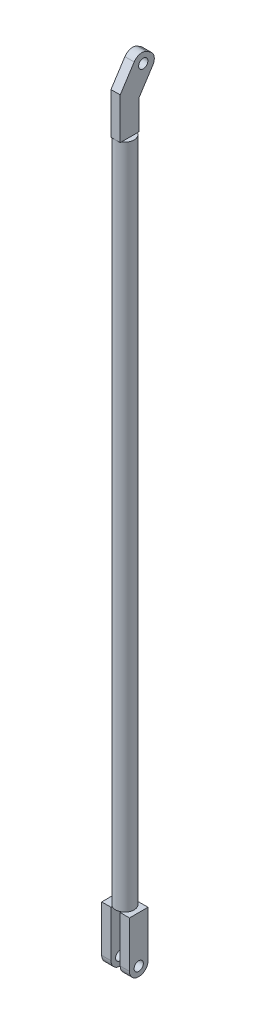
ISO-10303-21;
HEADER;
FILE_DESCRIPTION(('STEP AP214'),'2;1');
FILE_NAME('part.step','',(''),(''),'','','');
FILE_SCHEMA(('AUTOMOTIVE_DESIGN { 1 0 10303 214 1 1 1 1 }'));
ENDSEC;
DATA;
#1=APPLICATION_CONTEXT('core data for automotive mechanical design processes');
#2=APPLICATION_PROTOCOL_DEFINITION('international standard','automotive_design',2000,#1);
#3=PRODUCT_CONTEXT('',#1,'mechanical');
#4=PRODUCT('Part','Part','',(#3));
#5=PRODUCT_RELATED_PRODUCT_CATEGORY('part','',(#4));
#6=PRODUCT_DEFINITION_FORMATION('','',#4);
#7=PRODUCT_DEFINITION_CONTEXT('part definition',#1,'design');
#8=PRODUCT_DEFINITION('design','',#6,#7);
#9=PRODUCT_DEFINITION_SHAPE('','',#8);
#10=(LENGTH_UNIT() NAMED_UNIT(*) SI_UNIT(.MILLI.,.METRE.));
#11=(NAMED_UNIT(*) PLANE_ANGLE_UNIT() SI_UNIT($,.RADIAN.));
#12=(NAMED_UNIT(*) SI_UNIT($,.STERADIAN.) SOLID_ANGLE_UNIT());
#13=UNCERTAINTY_MEASURE_WITH_UNIT(LENGTH_MEASURE(1.E-05),#10,'distance_accuracy_value','');
#14=(GEOMETRIC_REPRESENTATION_CONTEXT(3) GLOBAL_UNCERTAINTY_ASSIGNED_CONTEXT((#13)) GLOBAL_UNIT_ASSIGNED_CONTEXT((#10,
#11,#12)) REPRESENTATION_CONTEXT('',''));
#15=CARTESIAN_POINT('',(0.,0.,0.));
#16=DIRECTION('',(0.,0.,1.));
#17=DIRECTION('',(1.,0.,0.));
#18=AXIS2_PLACEMENT_3D('',#15,#16,#17);
#19=CARTESIAN_POINT('',(0.,457.2,0.));
#20=DIRECTION('',(0.,1.,0.));
#21=DIRECTION('',(0.,0.,1.));
#22=AXIS2_PLACEMENT_3D('',#19,#20,#21);
#23=PLANE('',#22);
#24=CARTESIAN_POINT('',(0.,457.2,0.));
#25=DIRECTION('',(0.,1.,0.));
#26=DIRECTION('',(0.,0.,1.));
#27=AXIS2_PLACEMENT_3D('',#24,#25,#26);
#28=CIRCLE('',#27,12.7);
#29=CARTESIAN_POINT('',(-6.35,457.2,-10.9985226280624));
#30=VERTEX_POINT('',#29);
#31=CARTESIAN_POINT('',(-6.35,457.2,10.9985226280624));
#32=VERTEX_POINT('',#31);
#33=EDGE_CURVE('E390',#30,#32,#28,.T.);
#34=ORIENTED_EDGE('',*,*,#33,.T.);
#35=DIRECTION('',(0.,0.,-1.));
#36=VECTOR('',#35,1.);
#37=CARTESIAN_POINT('',(-6.35,457.2,12.7));
#38=LINE('',#37,#36);
#39=EDGE_CURVE('E268',#32,#30,#38,.T.);
#40=ORIENTED_EDGE('',*,*,#39,.T.);
#41=EDGE_LOOP('',(#34,#40));
#42=FACE_BOUND('',#41,.T.);
#43=ADVANCED_FACE('F30',(#42),#23,.T.);
#44=CARTESIAN_POINT('',(0.,-457.2,0.));
#45=DIRECTION('',(0.,1.,0.));
#46=DIRECTION('',(0.,0.,1.));
#47=AXIS2_PLACEMENT_3D('',#44,#45,#46);
#48=PLANE('',#47);
#49=DIRECTION('',(0.,0.,1.));
#50=VECTOR('',#49,1.);
#51=CARTESIAN_POINT('',(-6.35,-457.2,-12.7));
#52=LINE('',#51,#50);
#53=CARTESIAN_POINT('',(-6.35,-457.2,-10.9985226280624));
#54=VERTEX_POINT('',#53);
#55=CARTESIAN_POINT('',(-6.35,-457.2,10.9985226280624));
#56=VERTEX_POINT('',#55);
#57=EDGE_CURVE('E225',#54,#56,#52,.T.);
#58=ORIENTED_EDGE('',*,*,#57,.F.);
#59=CARTESIAN_POINT('',(0.,-457.2,0.));
#60=DIRECTION('',(0.,1.,0.));
#61=DIRECTION('',(0.,0.,1.));
#62=AXIS2_PLACEMENT_3D('',#59,#60,#61);
#63=CIRCLE('',#62,12.7);
#64=CARTESIAN_POINT('',(6.35,-457.2,-10.9985226280624));
#65=VERTEX_POINT('',#64);
#66=EDGE_CURVE('E264',#65,#54,#63,.T.);
#67=ORIENTED_EDGE('',*,*,#66,.F.);
#68=DIRECTION('',(0.,0.,-1.));
#69=VECTOR('',#68,1.);
#70=CARTESIAN_POINT('',(6.35,-457.2,-12.7));
#71=LINE('',#70,#69);
#72=CARTESIAN_POINT('',(6.35,-457.2,10.9985226280624));
#73=VERTEX_POINT('',#72);
#74=EDGE_CURVE('E247',#73,#65,#71,.T.);
#75=ORIENTED_EDGE('',*,*,#74,.F.);
#76=EDGE_CURVE('E258',#56,#73,#63,.T.);
#77=ORIENTED_EDGE('',*,*,#76,.F.);
#78=EDGE_LOOP('',(#58,#67,#75,#77));
#79=FACE_BOUND('',#78,.T.);
#80=ADVANCED_FACE('F432',(#79),#48,.F.);
#81=CARTESIAN_POINT('',(0.,457.2,0.));
#82=DIRECTION('',(0.,-1.,0.));
#83=DIRECTION('',(0.,0.,-1.));
#84=AXIS2_PLACEMENT_3D('',#81,#82,#83);
#85=CYLINDRICAL_SURFACE('',#84,12.7);
#86=CARTESIAN_POINT('',(0.,457.2,12.7));
#87=VERTEX_POINT('',#86);
#88=CARTESIAN_POINT('',(6.35,457.2,10.9985226280624));
#89=VERTEX_POINT('',#88);
#90=EDGE_CURVE('E187',#87,#89,#28,.T.);
#91=ORIENTED_EDGE('',*,*,#90,.F.);
#92=EDGE_CURVE('E261',#32,#87,#28,.T.);
#93=ORIENTED_EDGE('',*,*,#92,.F.);
#94=ORIENTED_EDGE('',*,*,#33,.F.);
#95=CARTESIAN_POINT('',(6.35,457.2,-10.9985226280624));
#96=VERTEX_POINT('',#95);
#97=EDGE_CURVE('E391',#96,#30,#28,.T.);
#98=ORIENTED_EDGE('',*,*,#97,.F.);
#99=EDGE_CURVE('E260',#89,#96,#28,.T.);
#100=ORIENTED_EDGE('',*,*,#99,.F.);
#101=EDGE_LOOP('',(#91,#93,#94,#98,#100));
#102=FACE_BOUND('',#101,.T.);
#103=EDGE_CURVE('E262',#73,#65,#63,.T.);
#104=ORIENTED_EDGE('',*,*,#103,.T.);
#105=ORIENTED_EDGE('',*,*,#66,.T.);
#106=EDGE_CURVE('E433',#54,#56,#63,.T.);
#107=ORIENTED_EDGE('',*,*,#106,.T.);
#108=ORIENTED_EDGE('',*,*,#76,.T.);
#109=EDGE_LOOP('',(#104,#105,#107,#108));
#110=FACE_BOUND('',#109,.T.);
#111=ADVANCED_FACE('F398',(#102,#110),#85,.T.);
#112=DIRECTION('',(0.,0.,-1.));
#113=VECTOR('',#112,1.);
#114=CARTESIAN_POINT('',(6.35,457.2,12.7));
#115=LINE('',#114,#113);
#116=EDGE_CURVE('E193',#89,#96,#115,.T.);
#117=ORIENTED_EDGE('',*,*,#116,.F.);
#118=ORIENTED_EDGE('',*,*,#99,.T.);
#119=EDGE_LOOP('',(#117,#118));
#120=FACE_BOUND('',#119,.T.);
#121=ADVANCED_FACE('F397',(#120),#23,.T.);
#122=CARTESIAN_POINT('',(19.05,-457.2,12.7));
#123=DIRECTION('',(0.,1.,0.));
#124=DIRECTION('',(0.,0.,1.));
#125=AXIS2_PLACEMENT_3D('',#122,#123,#124);
#126=PLANE('',#125);
#127=ORIENTED_EDGE('',*,*,#103,.F.);
#128=CARTESIAN_POINT('',(6.35,-457.2,12.7));
#129=VERTEX_POINT('',#128);
#130=EDGE_CURVE('E243',#129,#73,#71,.T.);
#131=ORIENTED_EDGE('',*,*,#130,.F.);
#132=DIRECTION('',(-1.,0.,0.));
#133=VECTOR('',#132,1.);
#134=CARTESIAN_POINT('',(6.35,-457.2,12.7));
#135=LINE('',#134,#133);
#136=CARTESIAN_POINT('',(19.05,-457.2,12.7));
#137=VERTEX_POINT('',#136);
#138=EDGE_CURVE('E239',#137,#129,#135,.T.);
#139=ORIENTED_EDGE('',*,*,#138,.F.);
#140=DIRECTION('',(0.,0.,1.));
#141=VECTOR('',#140,1.);
#142=CARTESIAN_POINT('',(19.05,-457.2,-12.7));
#143=LINE('',#142,#141);
#144=CARTESIAN_POINT('',(19.05,-457.2,-12.7));
#145=VERTEX_POINT('',#144);
#146=EDGE_CURVE('E236',#145,#137,#143,.T.);
#147=ORIENTED_EDGE('',*,*,#146,.F.);
#148=DIRECTION('',(1.,0.,0.));
#149=VECTOR('',#148,1.);
#150=CARTESIAN_POINT('',(6.35,-457.2,-12.7));
#151=LINE('',#150,#149);
#152=CARTESIAN_POINT('',(6.35,-457.2,-12.7));
#153=VERTEX_POINT('',#152);
#154=EDGE_CURVE('E246',#153,#145,#151,.T.);
#155=ORIENTED_EDGE('',*,*,#154,.F.);
#156=EDGE_CURVE('E242',#65,#153,#71,.T.);
#157=ORIENTED_EDGE('',*,*,#156,.F.);
#158=EDGE_LOOP('',(#127,#131,#139,#147,#155,#157));
#159=FACE_BOUND('',#158,.T.);
#160=ADVANCED_FACE('F410',(#159),#126,.T.);
#161=CARTESIAN_POINT('',(19.05,-533.4,-12.7));
#162=DIRECTION('',(-1.,0.,0.));
#163=DIRECTION('',(0.,0.,1.));
#164=AXIS2_PLACEMENT_3D('',#161,#162,#163);
#165=PLANE('',#164);
#166=CARTESIAN_POINT('',(19.05,-520.7,0.));
#167=DIRECTION('',(-1.,0.,0.));
#168=DIRECTION('',(0.,0.,1.));
#169=AXIS2_PLACEMENT_3D('',#166,#167,#168);
#170=CIRCLE('',#169,6.34999999999997);
#171=CARTESIAN_POINT('',(19.05,-520.7,6.34999999999997));
#172=VERTEX_POINT('',#171);
#173=EDGE_CURVE('E320',#172,#172,#170,.T.);
#174=ORIENTED_EDGE('',*,*,#173,.T.);
#175=EDGE_LOOP('',(#174));
#176=FACE_BOUND('',#175,.T.);
#177=CARTESIAN_POINT('',(19.05,-520.7,0.));
#178=DIRECTION('',(-1.,0.,0.));
#179=DIRECTION('',(0.,0.,1.));
#180=AXIS2_PLACEMENT_3D('',#177,#178,#179);
#181=CIRCLE('',#180,12.7);
#182=CARTESIAN_POINT('',(19.05,-520.7,12.7));
#183=VERTEX_POINT('',#182);
#184=CARTESIAN_POINT('',(19.05,-533.4,0.));
#185=VERTEX_POINT('',#184);
#186=EDGE_CURVE('E295',#183,#185,#181,.F.);
#187=ORIENTED_EDGE('',*,*,#186,.T.);
#188=CARTESIAN_POINT('',(19.05,-520.7,0.));
#189=DIRECTION('',(-1.,0.,0.));
#190=DIRECTION('',(0.,0.,1.));
#191=AXIS2_PLACEMENT_3D('',#188,#189,#190);
#192=CIRCLE('',#191,12.7);
#193=CARTESIAN_POINT('',(19.05,-520.7,-12.7));
#194=VERTEX_POINT('',#193);
#195=EDGE_CURVE('E297',#185,#194,#192,.F.);
#196=ORIENTED_EDGE('',*,*,#195,.T.);
#197=DIRECTION('',(0.,1.,0.));
#198=VECTOR('',#197,1.);
#199=CARTESIAN_POINT('',(19.05,-533.4,-12.7));
#200=LINE('',#199,#198);
#201=EDGE_CURVE('E250',#194,#145,#200,.T.);
#202=ORIENTED_EDGE('',*,*,#201,.T.);
#203=ORIENTED_EDGE('',*,*,#146,.T.);
#204=DIRECTION('',(0.,1.,0.));
#205=VECTOR('',#204,1.);
#206=CARTESIAN_POINT('',(19.05,-533.4,12.7));
#207=LINE('',#206,#205);
#208=EDGE_CURVE('E256',#183,#137,#207,.T.);
#209=ORIENTED_EDGE('',*,*,#208,.F.);
#210=EDGE_LOOP('',(#187,#196,#202,#203,#209));
#211=FACE_BOUND('',#210,.T.);
#212=ADVANCED_FACE('F418',(#176,#211),#165,.F.);
#213=CARTESIAN_POINT('',(6.35,-533.4,12.7));
#214=DIRECTION('',(0.,0.,-1.));
#215=DIRECTION('',(-1.,0.,0.));
#216=AXIS2_PLACEMENT_3D('',#213,#214,#215);
#217=PLANE('',#216);
#218=DIRECTION('',(0.,1.,0.));
#219=VECTOR('',#218,1.);
#220=CARTESIAN_POINT('',(6.35,-533.4,12.7));
#221=LINE('',#220,#219);
#222=CARTESIAN_POINT('',(6.35,-520.7,12.7));
#223=VERTEX_POINT('',#222);
#224=EDGE_CURVE('E254',#223,#129,#221,.T.);
#225=ORIENTED_EDGE('',*,*,#224,.F.);
#226=DIRECTION('',(-1.,0.,0.));
#227=VECTOR('',#226,1.);
#228=CARTESIAN_POINT('',(6.35,-520.7,12.7));
#229=LINE('',#228,#227);
#230=EDGE_CURVE('E39',#223,#183,#229,.F.);
#231=ORIENTED_EDGE('',*,*,#230,.T.);
#232=ORIENTED_EDGE('',*,*,#208,.T.);
#233=ORIENTED_EDGE('',*,*,#138,.T.);
#234=EDGE_LOOP('',(#225,#231,#232,#233));
#235=FACE_BOUND('',#234,.T.);
#236=ADVANCED_FACE('F424',(#235),#217,.F.);
#237=CARTESIAN_POINT('',(6.35,-533.4,-12.7));
#238=DIRECTION('',(1.,0.,0.));
#239=DIRECTION('',(0.,0.,-1.));
#240=AXIS2_PLACEMENT_3D('',#237,#238,#239);
#241=PLANE('',#240);
#242=CARTESIAN_POINT('',(6.35,-520.7,0.));
#243=DIRECTION('',(1.,0.,0.));
#244=DIRECTION('',(0.,0.,-1.));
#245=AXIS2_PLACEMENT_3D('',#242,#243,#244);
#246=CIRCLE('',#245,6.34999999999997);
#247=CARTESIAN_POINT('',(6.35,-520.7,-6.34999999999997));
#248=VERTEX_POINT('',#247);
#249=EDGE_CURVE('E736',#248,#248,#246,.T.);
#250=ORIENTED_EDGE('',*,*,#249,.T.);
#251=EDGE_LOOP('',(#250));
#252=FACE_BOUND('',#251,.T.);
#253=DIRECTION('',(0.,1.,0.));
#254=VECTOR('',#253,1.);
#255=CARTESIAN_POINT('',(6.35,-533.4,-12.7));
#256=LINE('',#255,#254);
#257=CARTESIAN_POINT('',(6.35,-520.7,-12.7));
#258=VERTEX_POINT('',#257);
#259=EDGE_CURVE('E252',#258,#153,#256,.T.);
#260=ORIENTED_EDGE('',*,*,#259,.F.);
#261=CARTESIAN_POINT('',(6.35,-520.7,0.));
#262=DIRECTION('',(1.,0.,0.));
#263=DIRECTION('',(0.,0.,-1.));
#264=AXIS2_PLACEMENT_3D('',#261,#262,#263);
#265=CIRCLE('',#264,12.7);
#266=CARTESIAN_POINT('',(6.35,-533.4,0.));
#267=VERTEX_POINT('',#266);
#268=EDGE_CURVE('E52',#258,#267,#265,.F.);
#269=ORIENTED_EDGE('',*,*,#268,.T.);
#270=CARTESIAN_POINT('',(6.35,-520.7,0.));
#271=DIRECTION('',(1.,0.,0.));
#272=DIRECTION('',(0.,0.,-1.));
#273=AXIS2_PLACEMENT_3D('',#270,#271,#272);
#274=CIRCLE('',#273,12.7);
#275=EDGE_CURVE('E47',#267,#223,#274,.F.);
#276=ORIENTED_EDGE('',*,*,#275,.T.);
#277=ORIENTED_EDGE('',*,*,#224,.T.);
#278=ORIENTED_EDGE('',*,*,#130,.T.);
#279=ORIENTED_EDGE('',*,*,#74,.T.);
#280=ORIENTED_EDGE('',*,*,#156,.T.);
#281=EDGE_LOOP('',(#260,#269,#276,#277,#278,#279,#280));
#282=FACE_BOUND('',#281,.T.);
#283=ADVANCED_FACE('F406',(#252,#282),#241,.F.);
#284=CARTESIAN_POINT('',(6.35,-533.4,-12.7));
#285=DIRECTION('',(0.,0.,1.));
#286=DIRECTION('',(1.,0.,0.));
#287=AXIS2_PLACEMENT_3D('',#284,#285,#286);
#288=PLANE('',#287);
#289=ORIENTED_EDGE('',*,*,#201,.F.);
#290=DIRECTION('',(1.,0.,0.));
#291=VECTOR('',#290,1.);
#292=CARTESIAN_POINT('',(6.35,-520.7,-12.7));
#293=LINE('',#292,#291);
#294=EDGE_CURVE('E299',#194,#258,#293,.F.);
#295=ORIENTED_EDGE('',*,*,#294,.T.);
#296=ORIENTED_EDGE('',*,*,#259,.T.);
#297=ORIENTED_EDGE('',*,*,#154,.T.);
#298=EDGE_LOOP('',(#289,#295,#296,#297));
#299=FACE_BOUND('',#298,.T.);
#300=ADVANCED_FACE('F414',(#299),#288,.F.);
#301=CARTESIAN_POINT('',(-19.05,-457.2,12.7));
#302=DIRECTION('',(0.,1.,0.));
#303=DIRECTION('',(0.,0.,1.));
#304=AXIS2_PLACEMENT_3D('',#301,#302,#303);
#305=PLANE('',#304);
#306=ORIENTED_EDGE('',*,*,#106,.F.);
#307=CARTESIAN_POINT('',(-6.35,-457.2,-12.7));
#308=VERTEX_POINT('',#307);
#309=EDGE_CURVE('E221',#308,#54,#52,.T.);
#310=ORIENTED_EDGE('',*,*,#309,.F.);
#311=DIRECTION('',(1.,0.,0.));
#312=VECTOR('',#311,1.);
#313=CARTESIAN_POINT('',(-19.05,-457.2,-12.7));
#314=LINE('',#313,#312);
#315=CARTESIAN_POINT('',(-19.05,-457.2,-12.7));
#316=VERTEX_POINT('',#315);
#317=EDGE_CURVE('E212',#316,#308,#314,.T.);
#318=ORIENTED_EDGE('',*,*,#317,.F.);
#319=DIRECTION('',(0.,0.,-1.));
#320=VECTOR('',#319,1.);
#321=CARTESIAN_POINT('',(-19.05,-457.2,-12.7));
#322=LINE('',#321,#320);
#323=CARTESIAN_POINT('',(-19.05,-457.2,12.7));
#324=VERTEX_POINT('',#323);
#325=EDGE_CURVE('E209',#324,#316,#322,.T.);
#326=ORIENTED_EDGE('',*,*,#325,.F.);
#327=DIRECTION('',(-1.,0.,0.));
#328=VECTOR('',#327,1.);
#329=CARTESIAN_POINT('',(-19.05,-457.2,12.7));
#330=LINE('',#329,#328);
#331=CARTESIAN_POINT('',(-6.35,-457.2,12.7));
#332=VERTEX_POINT('',#331);
#333=EDGE_CURVE('E224',#332,#324,#330,.T.);
#334=ORIENTED_EDGE('',*,*,#333,.F.);
#335=EDGE_CURVE('E220',#56,#332,#52,.T.);
#336=ORIENTED_EDGE('',*,*,#335,.F.);
#337=EDGE_LOOP('',(#306,#310,#318,#326,#334,#336));
#338=FACE_BOUND('',#337,.T.);
#339=ADVANCED_FACE('F437',(#338),#305,.T.);
#340=CARTESIAN_POINT('',(-19.05,-533.4,-12.7));
#341=DIRECTION('',(1.,0.,0.));
#342=DIRECTION('',(0.,0.,-1.));
#343=AXIS2_PLACEMENT_3D('',#340,#341,#342);
#344=PLANE('',#343);
#345=CARTESIAN_POINT('',(-19.05,-520.7,0.));
#346=DIRECTION('',(-1.,0.,0.));
#347=DIRECTION('',(0.,0.,1.));
#348=AXIS2_PLACEMENT_3D('',#345,#346,#347);
#349=CIRCLE('',#348,6.34999999999997);
#350=CARTESIAN_POINT('',(-19.05,-520.7,6.34999999999997));
#351=VERTEX_POINT('',#350);
#352=EDGE_CURVE('E741',#351,#351,#349,.T.);
#353=ORIENTED_EDGE('',*,*,#352,.F.);
#354=EDGE_LOOP('',(#353));
#355=FACE_BOUND('',#354,.T.);
#356=DIRECTION('',(0.,1.,0.));
#357=VECTOR('',#356,1.);
#358=CARTESIAN_POINT('',(-19.05,-533.4,-12.7));
#359=LINE('',#358,#357);
#360=CARTESIAN_POINT('',(-19.05,-520.7,-12.7));
#361=VERTEX_POINT('',#360);
#362=EDGE_CURVE('E234',#361,#316,#359,.T.);
#363=ORIENTED_EDGE('',*,*,#362,.F.);
#364=CARTESIAN_POINT('',(-19.05,-520.7,0.));
#365=DIRECTION('',(1.,0.,0.));
#366=DIRECTION('',(0.,0.,-1.));
#367=AXIS2_PLACEMENT_3D('',#364,#365,#366);
#368=CIRCLE('',#367,12.7);
#369=CARTESIAN_POINT('',(-19.05,-533.4,0.));
#370=VERTEX_POINT('',#369);
#371=EDGE_CURVE('E293',#361,#370,#368,.F.);
#372=ORIENTED_EDGE('',*,*,#371,.T.);
#373=CARTESIAN_POINT('',(-19.05,-520.7,0.));
#374=DIRECTION('',(1.,0.,0.));
#375=DIRECTION('',(0.,0.,-1.));
#376=AXIS2_PLACEMENT_3D('',#373,#374,#375);
#377=CIRCLE('',#376,12.7);
#378=CARTESIAN_POINT('',(-19.05,-520.7,12.7));
#379=VERTEX_POINT('',#378);
#380=EDGE_CURVE('E291',#370,#379,#377,.F.);
#381=ORIENTED_EDGE('',*,*,#380,.T.);
#382=DIRECTION('',(0.,1.,0.));
#383=VECTOR('',#382,1.);
#384=CARTESIAN_POINT('',(-19.05,-533.4,12.7));
#385=LINE('',#384,#383);
#386=EDGE_CURVE('E228',#379,#324,#385,.T.);
#387=ORIENTED_EDGE('',*,*,#386,.T.);
#388=ORIENTED_EDGE('',*,*,#325,.T.);
#389=EDGE_LOOP('',(#363,#372,#381,#387,#388));
#390=FACE_BOUND('',#389,.T.);
#391=ADVANCED_FACE('F451',(#355,#390),#344,.F.);
#392=CARTESIAN_POINT('',(-19.05,-533.4,-12.7));
#393=DIRECTION('',(0.,0.,1.));
#394=DIRECTION('',(1.,0.,0.));
#395=AXIS2_PLACEMENT_3D('',#392,#393,#394);
#396=PLANE('',#395);
#397=DIRECTION('',(0.,1.,0.));
#398=VECTOR('',#397,1.);
#399=CARTESIAN_POINT('',(-6.35,-533.4,-12.7));
#400=LINE('',#399,#398);
#401=CARTESIAN_POINT('',(-6.35,-520.7,-12.7));
#402=VERTEX_POINT('',#401);
#403=EDGE_CURVE('E232',#402,#308,#400,.T.);
#404=ORIENTED_EDGE('',*,*,#403,.F.);
#405=DIRECTION('',(1.,0.,0.));
#406=VECTOR('',#405,1.);
#407=CARTESIAN_POINT('',(-19.05,-520.7,-12.7));
#408=LINE('',#407,#406);
#409=EDGE_CURVE('E288',#402,#361,#408,.F.);
#410=ORIENTED_EDGE('',*,*,#409,.T.);
#411=ORIENTED_EDGE('',*,*,#362,.T.);
#412=ORIENTED_EDGE('',*,*,#317,.T.);
#413=EDGE_LOOP('',(#404,#410,#411,#412));
#414=FACE_BOUND('',#413,.T.);
#415=ADVANCED_FACE('F447',(#414),#396,.F.);
#416=CARTESIAN_POINT('',(-6.35,-533.4,-12.7));
#417=DIRECTION('',(-1.,0.,0.));
#418=DIRECTION('',(0.,0.,1.));
#419=AXIS2_PLACEMENT_3D('',#416,#417,#418);
#420=PLANE('',#419);
#421=CARTESIAN_POINT('',(-6.35,-520.7,0.));
#422=DIRECTION('',(-1.,0.,0.));
#423=DIRECTION('',(0.,0.,1.));
#424=AXIS2_PLACEMENT_3D('',#421,#422,#423);
#425=CIRCLE('',#424,6.34999999999997);
#426=CARTESIAN_POINT('',(-6.35,-520.7,6.34999999999997));
#427=VERTEX_POINT('',#426);
#428=EDGE_CURVE('E34',#427,#427,#425,.T.);
#429=ORIENTED_EDGE('',*,*,#428,.T.);
#430=EDGE_LOOP('',(#429));
#431=FACE_BOUND('',#430,.T.);
#432=CARTESIAN_POINT('',(-6.35,-520.7,0.));
#433=DIRECTION('',(-1.,0.,0.));
#434=DIRECTION('',(0.,0.,1.));
#435=AXIS2_PLACEMENT_3D('',#432,#433,#434);
#436=CIRCLE('',#435,12.7);
#437=CARTESIAN_POINT('',(-6.35,-520.7,12.7));
#438=VERTEX_POINT('',#437);
#439=CARTESIAN_POINT('',(-6.35,-533.4,0.));
#440=VERTEX_POINT('',#439);
#441=EDGE_CURVE('E284',#438,#440,#436,.F.);
#442=ORIENTED_EDGE('',*,*,#441,.T.);
#443=CARTESIAN_POINT('',(-6.35,-520.7,0.));
#444=DIRECTION('',(-1.,0.,0.));
#445=DIRECTION('',(0.,0.,1.));
#446=AXIS2_PLACEMENT_3D('',#443,#444,#445);
#447=CIRCLE('',#446,12.7);
#448=EDGE_CURVE('E286',#440,#402,#447,.F.);
#449=ORIENTED_EDGE('',*,*,#448,.T.);
#450=ORIENTED_EDGE('',*,*,#403,.T.);
#451=ORIENTED_EDGE('',*,*,#309,.T.);
#452=ORIENTED_EDGE('',*,*,#57,.T.);
#453=ORIENTED_EDGE('',*,*,#335,.T.);
#454=DIRECTION('',(0.,1.,0.));
#455=VECTOR('',#454,1.);
#456=CARTESIAN_POINT('',(-6.35,-533.4,12.7));
#457=LINE('',#456,#455);
#458=EDGE_CURVE('E230',#438,#332,#457,.T.);
#459=ORIENTED_EDGE('',*,*,#458,.F.);
#460=EDGE_LOOP('',(#442,#449,#450,#451,#452,#453,#459));
#461=FACE_BOUND('',#460,.T.);
#462=ADVANCED_FACE('F442',(#431,#461),#420,.F.);
#463=CARTESIAN_POINT('',(-19.05,-533.4,12.7));
#464=DIRECTION('',(0.,0.,-1.));
#465=DIRECTION('',(-1.,0.,0.));
#466=AXIS2_PLACEMENT_3D('',#463,#464,#465);
#467=PLANE('',#466);
#468=ORIENTED_EDGE('',*,*,#386,.F.);
#469=DIRECTION('',(-1.,0.,0.));
#470=VECTOR('',#469,1.);
#471=CARTESIAN_POINT('',(-19.05,-520.7,12.7));
#472=LINE('',#471,#470);
#473=EDGE_CURVE('E11',#379,#438,#472,.F.);
#474=ORIENTED_EDGE('',*,*,#473,.T.);
#475=ORIENTED_EDGE('',*,*,#458,.T.);
#476=ORIENTED_EDGE('',*,*,#333,.T.);
#477=EDGE_LOOP('',(#468,#474,#475,#476));
#478=FACE_BOUND('',#477,.T.);
#479=ADVANCED_FACE('F456',(#478),#467,.F.);
#480=CARTESIAN_POINT('',(6.35,457.2,12.7));
#481=DIRECTION('',(0.,1.,0.));
#482=DIRECTION('',(0.,0.,1.));
#483=AXIS2_PLACEMENT_3D('',#480,#481,#482);
#484=PLANE('',#483);
#485=CARTESIAN_POINT('',(6.35,457.2,-12.8862828907296));
#486=VERTEX_POINT('',#485);
#487=EDGE_CURVE('E191',#96,#486,#115,.T.);
#488=ORIENTED_EDGE('',*,*,#487,.F.);
#489=ORIENTED_EDGE('',*,*,#97,.T.);
#490=CARTESIAN_POINT('',(-6.35,457.2,-12.8862828907296));
#491=VERTEX_POINT('',#490);
#492=EDGE_CURVE('E333',#30,#491,#38,.T.);
#493=ORIENTED_EDGE('',*,*,#492,.T.);
#494=DIRECTION('',(-1.,0.,0.));
#495=VECTOR('',#494,1.);
#496=CARTESIAN_POINT('',(6.35,457.2,-12.8862828907296));
#497=LINE('',#496,#495);
#498=EDGE_CURVE('E214',#486,#491,#497,.T.);
#499=ORIENTED_EDGE('',*,*,#498,.F.);
#500=EDGE_LOOP('',(#488,#489,#493,#499));
#501=FACE_BOUND('',#500,.T.);
#502=ADVANCED_FACE('F400',(#501),#484,.F.);
#503=DIRECTION('',(-1.,0.,0.));
#504=VECTOR('',#503,1.);
#505=CARTESIAN_POINT('',(6.35,457.2,12.7));
#506=LINE('',#505,#504);
#507=CARTESIAN_POINT('',(6.35,457.2,12.7));
#508=VERTEX_POINT('',#507);
#509=EDGE_CURVE('E186',#508,#87,#506,.T.);
#510=ORIENTED_EDGE('',*,*,#509,.T.);
#511=ORIENTED_EDGE('',*,*,#90,.T.);
#512=EDGE_CURVE('E182',#508,#89,#115,.T.);
#513=ORIENTED_EDGE('',*,*,#512,.F.);
#514=EDGE_LOOP('',(#510,#511,#513));
#515=FACE_BOUND('',#514,.T.);
#516=ADVANCED_FACE('F184',(#515),#484,.F.);
#517=CARTESIAN_POINT('',(-6.35,457.2,12.7));
#518=VERTEX_POINT('',#517);
#519=EDGE_CURVE('E334',#518,#32,#38,.T.);
#520=ORIENTED_EDGE('',*,*,#519,.T.);
#521=ORIENTED_EDGE('',*,*,#92,.T.);
#522=EDGE_CURVE('E208',#87,#518,#506,.T.);
#523=ORIENTED_EDGE('',*,*,#522,.T.);
#524=EDGE_LOOP('',(#520,#521,#523));
#525=FACE_BOUND('',#524,.T.);
#526=ADVANCED_FACE('F386',(#525),#484,.F.);
#527=CARTESIAN_POINT('',(6.35,457.2,12.7));
#528=DIRECTION('',(0.,0.,-1.));
#529=DIRECTION('',(-1.,0.,0.));
#530=AXIS2_PLACEMENT_3D('',#527,#528,#529);
#531=PLANE('',#530);
#532=DIRECTION('',(0.,-1.,0.));
#533=VECTOR('',#532,1.);
#534=CARTESIAN_POINT('',(-6.35,457.2,12.7));
#535=LINE('',#534,#533);
#536=CARTESIAN_POINT('',(-6.35,513.918465084824,12.7));
#537=VERTEX_POINT('',#536);
#538=EDGE_CURVE('E307',#537,#518,#535,.T.);
#539=ORIENTED_EDGE('',*,*,#538,.T.);
#540=ORIENTED_EDGE('',*,*,#522,.F.);
#541=ORIENTED_EDGE('',*,*,#509,.F.);
#542=DIRECTION('',(0.,-1.,0.));
#543=VECTOR('',#542,1.);
#544=CARTESIAN_POINT('',(6.35,457.2,12.7));
#545=LINE('',#544,#543);
#546=CARTESIAN_POINT('',(6.35,513.918465084824,12.7));
#547=VERTEX_POINT('',#546);
#548=EDGE_CURVE('E195',#547,#508,#545,.T.);
#549=ORIENTED_EDGE('',*,*,#548,.F.);
#550=DIRECTION('',(-1.,0.,0.));
#551=VECTOR('',#550,1.);
#552=CARTESIAN_POINT('',(6.35,513.918465084824,12.7));
#553=LINE('',#552,#551);
#554=EDGE_CURVE('E331',#547,#537,#553,.T.);
#555=ORIENTED_EDGE('',*,*,#554,.T.);
#556=EDGE_LOOP('',(#539,#540,#541,#549,#555));
#557=FACE_BOUND('',#556,.T.);
#558=ADVANCED_FACE('F207',(#557),#531,.F.);
#559=CARTESIAN_POINT('',(6.35,457.2,-12.8862828907296));
#560=DIRECTION('',(0.,0.,1.));
#561=DIRECTION('',(1.,0.,0.));
#562=AXIS2_PLACEMENT_3D('',#559,#560,#561);
#563=PLANE('',#562);
#564=DIRECTION('',(0.,1.,0.));
#565=VECTOR('',#564,1.);
#566=CARTESIAN_POINT('',(-6.35,457.2,-12.8862828907296));
#567=LINE('',#566,#565);
#568=CARTESIAN_POINT('',(-6.35,497.354270934925,-12.8862828907296));
#569=VERTEX_POINT('',#568);
#570=EDGE_CURVE('E337',#491,#569,#567,.T.);
#571=ORIENTED_EDGE('',*,*,#570,.T.);
#572=DIRECTION('',(-1.,0.,0.));
#573=VECTOR('',#572,1.);
#574=CARTESIAN_POINT('',(6.35,497.354270934925,-12.8862828907296));
#575=LINE('',#574,#573);
#576=CARTESIAN_POINT('',(6.35,497.354270934925,-12.8862828907296));
#577=VERTEX_POINT('',#576);
#578=EDGE_CURVE('E346',#577,#569,#575,.T.);
#579=ORIENTED_EDGE('',*,*,#578,.F.);
#580=DIRECTION('',(0.,1.,0.));
#581=VECTOR('',#580,1.);
#582=CARTESIAN_POINT('',(6.35,457.2,-12.8862828907296));
#583=LINE('',#582,#581);
#584=EDGE_CURVE('E190',#486,#577,#583,.T.);
#585=ORIENTED_EDGE('',*,*,#584,.F.);
#586=ORIENTED_EDGE('',*,*,#498,.T.);
#587=EDGE_LOOP('',(#571,#579,#585,#586));
#588=FACE_BOUND('',#587,.T.);
#589=ADVANCED_FACE('F357',(#588),#563,.F.);
#590=CARTESIAN_POINT('',(6.35,497.354270934925,-12.8862828907296));
#591=DIRECTION('',(0.,0.543444689957327,0.839444976729973));
#592=DIRECTION('',(0.,-0.839444976729973,0.543444689957327));
#593=AXIS2_PLACEMENT_3D('',#590,#591,#592);
#594=PLANE('',#593);
#595=DIRECTION('',(0.,0.839444976729973,-0.543444689957327));
#596=VECTOR('',#595,1.);
#597=CARTESIAN_POINT('',(-6.35,497.354270934925,-12.8862828907296));
#598=LINE('',#597,#596);
#599=CARTESIAN_POINT('',(-6.35,526.876142195666,-31.998320747875));
#600=VERTEX_POINT('',#599);
#601=EDGE_CURVE('E339',#569,#600,#598,.T.);
#602=ORIENTED_EDGE('',*,*,#601,.T.);
#603=DIRECTION('',(-1.,0.,0.));
#604=VECTOR('',#603,1.);
#605=CARTESIAN_POINT('',(6.35,526.876142195666,-31.998320747875));
#606=LINE('',#605,#604);
#607=CARTESIAN_POINT('',(6.35,526.876142195666,-31.998320747875));
#608=VERTEX_POINT('',#607);
#609=EDGE_CURVE('E275',#600,#608,#606,.F.);
#610=ORIENTED_EDGE('',*,*,#609,.T.);
#611=DIRECTION('',(0.,0.839444976729973,-0.543444689957327));
#612=VECTOR('',#611,1.);
#613=CARTESIAN_POINT('',(6.35,497.354270934925,-12.8862828907296));
#614=LINE('',#613,#612);
#615=EDGE_CURVE('E325',#577,#608,#614,.T.);
#616=ORIENTED_EDGE('',*,*,#615,.F.);
#617=ORIENTED_EDGE('',*,*,#578,.T.);
#618=EDGE_LOOP('',(#602,#610,#616,#617));
#619=FACE_BOUND('',#618,.T.);
#620=ADVANCED_FACE('F366',(#619),#594,.F.);
#621=CARTESIAN_POINT('',(6.35,537.537093400137,-38.900068310333));
#622=DIRECTION('',(0.,-0.839444976729974,0.543444689957326));
#623=DIRECTION('',(0.,-0.543444689957326,-0.839444976729974));
#624=AXIS2_PLACEMENT_3D('',#621,#622,#623);
#625=PLANE('',#624);
#626=DIRECTION('',(0.,0.543444689957326,0.839444976729974));
#627=VECTOR('',#626,1.);
#628=CARTESIAN_POINT('',(6.35,537.537093400137,-38.900068310333));
#629=LINE('',#628,#627);
#630=CARTESIAN_POINT('',(6.35,544.438840962595,-28.2391171058624));
#631=VERTEX_POINT('',#630);
#632=CARTESIAN_POINT('',(6.35,547.199539987578,-23.9747366240742));
#633=VERTEX_POINT('',#632);
#634=EDGE_CURVE('E327',#631,#633,#629,.T.);
#635=ORIENTED_EDGE('',*,*,#634,.F.);
#636=DIRECTION('',(-1.,0.,0.));
#637=VECTOR('',#636,1.);
#638=CARTESIAN_POINT('',(6.35,544.438840962595,-28.2391171058624));
#639=LINE('',#638,#637);
#640=CARTESIAN_POINT('',(-6.35,544.438840962595,-28.2391171058624));
#641=VERTEX_POINT('',#640);
#642=EDGE_CURVE('E267',#631,#641,#639,.T.);
#643=ORIENTED_EDGE('',*,*,#642,.T.);
#644=DIRECTION('',(0.,0.543444689957326,0.839444976729974));
#645=VECTOR('',#644,1.);
#646=CARTESIAN_POINT('',(-6.35,537.537093400137,-38.900068310333));
#647=LINE('',#646,#645);
#648=CARTESIAN_POINT('',(-6.35,547.199539987578,-23.9747366240742));
#649=VERTEX_POINT('',#648);
#650=EDGE_CURVE('E342',#641,#649,#647,.T.);
#651=ORIENTED_EDGE('',*,*,#650,.T.);
#652=DIRECTION('',(-1.,0.,0.));
#653=VECTOR('',#652,1.);
#654=CARTESIAN_POINT('',(6.35,547.199539987578,-23.9747366240741));
#655=LINE('',#654,#653);
#656=EDGE_CURVE('E265',#649,#633,#655,.F.);
#657=ORIENTED_EDGE('',*,*,#656,.T.);
#658=EDGE_LOOP('',(#635,#643,#651,#657));
#659=FACE_BOUND('',#658,.T.);
#660=ADVANCED_FACE('F374',(#659),#625,.F.);
#661=CARTESIAN_POINT('',(6.35,513.918465084824,12.7));
#662=DIRECTION('',(0.,-0.543444689957327,-0.839444976729973));
#663=DIRECTION('',(0.,0.839444976729973,-0.543444689957327));
#664=AXIS2_PLACEMENT_3D('',#661,#662,#663);
#665=PLANE('',#664);
#666=DIRECTION('',(0.,-0.839444976729973,0.543444689957327));
#667=VECTOR('',#666,1.);
#668=CARTESIAN_POINT('',(6.35,513.918465084824,12.7));
#669=LINE('',#668,#667);
#670=CARTESIAN_POINT('',(6.35,543.440336345566,-6.41203785714539));
#671=VERTEX_POINT('',#670);
#672=EDGE_CURVE('E199',#671,#547,#669,.T.);
#673=ORIENTED_EDGE('',*,*,#672,.F.);
#674=DIRECTION('',(-1.,0.,0.));
#675=VECTOR('',#674,1.);
#676=CARTESIAN_POINT('',(6.35,543.440336345566,-6.41203785714539));
#677=LINE('',#676,#675);
#678=CARTESIAN_POINT('',(-6.35,543.440336345566,-6.41203785714539));
#679=VERTEX_POINT('',#678);
#680=EDGE_CURVE('E281',#671,#679,#677,.T.);
#681=ORIENTED_EDGE('',*,*,#680,.T.);
#682=DIRECTION('',(0.,-0.839444976729973,0.543444689957327));
#683=VECTOR('',#682,1.);
#684=CARTESIAN_POINT('',(-6.35,513.918465084824,12.7));
#685=LINE('',#684,#683);
#686=EDGE_CURVE('E203',#679,#537,#685,.T.);
#687=ORIENTED_EDGE('',*,*,#686,.T.);
#688=ORIENTED_EDGE('',*,*,#554,.F.);
#689=EDGE_LOOP('',(#673,#681,#687,#688));
#690=FACE_BOUND('',#689,.T.);
#691=ADVANCED_FACE('F380',(#690),#665,.F.);
#692=CARTESIAN_POINT('',(6.35,457.2,12.7));
#693=DIRECTION('',(-1.,0.,0.));
#694=DIRECTION('',(0.,0.,1.));
#695=AXIS2_PLACEMENT_3D('',#692,#693,#694);
#696=PLANE('',#695);
#697=CARTESIAN_POINT('',(6.35,535.357988328627,-18.8966320916308));
#698=DIRECTION('',(-1.,0.,0.));
#699=DIRECTION('',(0.,0.,1.));
#700=AXIS2_PLACEMENT_3D('',#697,#698,#699);
#701=CIRCLE('',#700,6.34999999999997);
#702=CARTESIAN_POINT('',(6.35,535.357988328627,-12.5466320916309));
#703=VERTEX_POINT('',#702);
#704=EDGE_CURVE('E310',#703,#703,#701,.T.);
#705=ORIENTED_EDGE('',*,*,#704,.T.);
#706=EDGE_LOOP('',(#705));
#707=FACE_BOUND('',#706,.T.);
#708=ORIENTED_EDGE('',*,*,#615,.T.);
#709=CARTESIAN_POINT('',(6.35,533.777889758125,-21.3373695434043));
#710=DIRECTION('',(-1.,0.,0.));
#711=DIRECTION('',(0.,0.,1.));
#712=AXIS2_PLACEMENT_3D('',#709,#710,#711);
#713=CIRCLE('',#712,12.7);
#714=EDGE_CURVE('E279',#608,#631,#713,.F.);
#715=ORIENTED_EDGE('',*,*,#714,.T.);
#716=ORIENTED_EDGE('',*,*,#634,.T.);
#717=CARTESIAN_POINT('',(6.35,536.538588783108,-17.0729890616161));
#718=DIRECTION('',(-1.,0.,0.));
#719=DIRECTION('',(0.,0.,1.));
#720=AXIS2_PLACEMENT_3D('',#717,#718,#719);
#721=CIRCLE('',#720,12.7);
#722=EDGE_CURVE('E277',#633,#671,#721,.F.);
#723=ORIENTED_EDGE('',*,*,#722,.T.);
#724=ORIENTED_EDGE('',*,*,#672,.T.);
#725=ORIENTED_EDGE('',*,*,#548,.T.);
#726=ORIENTED_EDGE('',*,*,#512,.T.);
#727=ORIENTED_EDGE('',*,*,#116,.T.);
#728=ORIENTED_EDGE('',*,*,#487,.T.);
#729=ORIENTED_EDGE('',*,*,#584,.T.);
#730=EDGE_LOOP('',(#708,#715,#716,#723,#724,#725,#726,#727,#728,#729));
#731=FACE_BOUND('',#730,.T.);
#732=ADVANCED_FACE('F197',(#707,#731),#696,.F.);
#733=CARTESIAN_POINT('',(-6.35,457.2,12.7));
#734=DIRECTION('',(-1.,0.,0.));
#735=DIRECTION('',(0.,0.,1.));
#736=AXIS2_PLACEMENT_3D('',#733,#734,#735);
#737=PLANE('',#736);
#738=CARTESIAN_POINT('',(-6.35,535.357988328627,-18.8966320916308));
#739=DIRECTION('',(-1.,0.,0.));
#740=DIRECTION('',(0.,0.,1.));
#741=AXIS2_PLACEMENT_3D('',#738,#739,#740);
#742=CIRCLE('',#741,6.34999999999997);
#743=CARTESIAN_POINT('',(-6.35,535.357988328627,-12.5466320916309));
#744=VERTEX_POINT('',#743);
#745=EDGE_CURVE('E315',#744,#744,#742,.T.);
#746=ORIENTED_EDGE('',*,*,#745,.F.);
#747=EDGE_LOOP('',(#746));
#748=FACE_BOUND('',#747,.T.);
#749=ORIENTED_EDGE('',*,*,#650,.F.);
#750=CARTESIAN_POINT('',(-6.35,533.777889758125,-21.3373695434043));
#751=DIRECTION('',(-1.,0.,0.));
#752=DIRECTION('',(0.,0.,1.));
#753=AXIS2_PLACEMENT_3D('',#750,#751,#752);
#754=CIRCLE('',#753,12.7);
#755=EDGE_CURVE('E273',#641,#600,#754,.T.);
#756=ORIENTED_EDGE('',*,*,#755,.T.);
#757=ORIENTED_EDGE('',*,*,#601,.F.);
#758=ORIENTED_EDGE('',*,*,#570,.F.);
#759=ORIENTED_EDGE('',*,*,#492,.F.);
#760=ORIENTED_EDGE('',*,*,#39,.F.);
#761=ORIENTED_EDGE('',*,*,#519,.F.);
#762=ORIENTED_EDGE('',*,*,#538,.F.);
#763=ORIENTED_EDGE('',*,*,#686,.F.);
#764=CARTESIAN_POINT('',(-6.35,536.538588783108,-17.0729890616161));
#765=DIRECTION('',(-1.,0.,0.));
#766=DIRECTION('',(0.,0.,1.));
#767=AXIS2_PLACEMENT_3D('',#764,#765,#766);
#768=CIRCLE('',#767,12.7);
#769=EDGE_CURVE('E271',#679,#649,#768,.T.);
#770=ORIENTED_EDGE('',*,*,#769,.T.);
#771=EDGE_LOOP('',(#749,#756,#757,#758,#759,#760,#761,#762,#763,#770));
#772=FACE_BOUND('',#771,.T.);
#773=ADVANCED_FACE('F363',(#748,#772),#737,.T.);
#774=CARTESIAN_POINT('',(6.35,533.777889758125,-21.3373695434043));
#775=DIRECTION('',(-1.,0.,0.));
#776=DIRECTION('',(0.,0.,1.));
#777=AXIS2_PLACEMENT_3D('',#774,#775,#776);
#778=CYLINDRICAL_SURFACE('',#777,12.7);
#779=ORIENTED_EDGE('',*,*,#714,.F.);
#780=ORIENTED_EDGE('',*,*,#609,.F.);
#781=ORIENTED_EDGE('',*,*,#755,.F.);
#782=ORIENTED_EDGE('',*,*,#642,.F.);
#783=EDGE_LOOP('',(#779,#780,#781,#782));
#784=FACE_BOUND('',#783,.T.);
#785=ADVANCED_FACE('F369',(#784),#778,.T.);
#786=CARTESIAN_POINT('',(6.35,536.538588783108,-17.0729890616161));
#787=DIRECTION('',(-1.,0.,0.));
#788=DIRECTION('',(0.,0.,1.));
#789=AXIS2_PLACEMENT_3D('',#786,#787,#788);
#790=CYLINDRICAL_SURFACE('',#789,12.7);
#791=ORIENTED_EDGE('',*,*,#722,.F.);
#792=ORIENTED_EDGE('',*,*,#656,.F.);
#793=ORIENTED_EDGE('',*,*,#769,.F.);
#794=ORIENTED_EDGE('',*,*,#680,.F.);
#795=EDGE_LOOP('',(#791,#792,#793,#794));
#796=FACE_BOUND('',#795,.T.);
#797=ADVANCED_FACE('F377',(#796),#790,.T.);
#798=CARTESIAN_POINT('',(-19.05,-520.7,0.));
#799=DIRECTION('',(-1.,0.,0.));
#800=DIRECTION('',(0.,0.,1.));
#801=AXIS2_PLACEMENT_3D('',#798,#799,#800);
#802=CYLINDRICAL_SURFACE('',#801,12.7);
#803=ORIENTED_EDGE('',*,*,#473,.F.);
#804=ORIENTED_EDGE('',*,*,#380,.F.);
#805=DIRECTION('',(-1.,0.,0.));
#806=VECTOR('',#805,1.);
#807=CARTESIAN_POINT('',(-19.05,-533.4,0.));
#808=LINE('',#807,#806);
#809=EDGE_CURVE('E305',#440,#370,#808,.T.);
#810=ORIENTED_EDGE('',*,*,#809,.F.);
#811=ORIENTED_EDGE('',*,*,#441,.F.);
#812=EDGE_LOOP('',(#803,#804,#810,#811));
#813=FACE_BOUND('',#812,.T.);
#814=ADVANCED_FACE('F461',(#813),#802,.T.);
#815=CARTESIAN_POINT('',(-19.05,-520.7,0.));
#816=DIRECTION('',(1.,0.,0.));
#817=DIRECTION('',(0.,0.,-1.));
#818=AXIS2_PLACEMENT_3D('',#815,#816,#817);
#819=CYLINDRICAL_SURFACE('',#818,12.7);
#820=ORIENTED_EDGE('',*,*,#371,.F.);
#821=ORIENTED_EDGE('',*,*,#409,.F.);
#822=ORIENTED_EDGE('',*,*,#448,.F.);
#823=ORIENTED_EDGE('',*,*,#809,.T.);
#824=EDGE_LOOP('',(#820,#821,#822,#823));
#825=FACE_BOUND('',#824,.T.);
#826=ADVANCED_FACE('F463',(#825),#819,.T.);
#827=CARTESIAN_POINT('',(19.05,-520.7,0.));
#828=DIRECTION('',(-1.,0.,0.));
#829=DIRECTION('',(0.,0.,1.));
#830=AXIS2_PLACEMENT_3D('',#827,#828,#829);
#831=CYLINDRICAL_SURFACE('',#830,12.7);
#832=ORIENTED_EDGE('',*,*,#230,.F.);
#833=ORIENTED_EDGE('',*,*,#275,.F.);
#834=DIRECTION('',(-1.,0.,0.));
#835=VECTOR('',#834,1.);
#836=CARTESIAN_POINT('',(19.05,-533.4,0.));
#837=LINE('',#836,#835);
#838=EDGE_CURVE('E308',#185,#267,#837,.T.);
#839=ORIENTED_EDGE('',*,*,#838,.F.);
#840=ORIENTED_EDGE('',*,*,#186,.F.);
#841=EDGE_LOOP('',(#832,#833,#839,#840));
#842=FACE_BOUND('',#841,.T.);
#843=ADVANCED_FACE('F32',(#842),#831,.T.);
#844=CARTESIAN_POINT('',(19.05,-520.7,0.));
#845=DIRECTION('',(1.,0.,0.));
#846=DIRECTION('',(0.,0.,-1.));
#847=AXIS2_PLACEMENT_3D('',#844,#845,#846);
#848=CYLINDRICAL_SURFACE('',#847,12.7);
#849=ORIENTED_EDGE('',*,*,#268,.F.);
#850=ORIENTED_EDGE('',*,*,#294,.F.);
#851=ORIENTED_EDGE('',*,*,#195,.F.);
#852=ORIENTED_EDGE('',*,*,#838,.T.);
#853=EDGE_LOOP('',(#849,#850,#851,#852));
#854=FACE_BOUND('',#853,.T.);
#855=ADVANCED_FACE('F416',(#854),#848,.T.);
#856=CARTESIAN_POINT('',(-6.35,535.357988328627,-18.8966320916308));
#857=DIRECTION('',(-1.,0.,0.));
#858=DIRECTION('',(0.,0.,1.));
#859=AXIS2_PLACEMENT_3D('',#856,#857,#858);
#860=CYLINDRICAL_SURFACE('',#859,6.34999999999997);
#861=ORIENTED_EDGE('',*,*,#745,.T.);
#862=EDGE_LOOP('',(#861));
#863=FACE_BOUND('',#862,.T.);
#864=ORIENTED_EDGE('',*,*,#704,.F.);
#865=EDGE_LOOP('',(#864));
#866=FACE_BOUND('',#865,.T.);
#867=ADVANCED_FACE('F519',(#863,#866),#860,.F.);
#868=CARTESIAN_POINT('',(-19.05,-520.7,0.));
#869=DIRECTION('',(-1.,0.,0.));
#870=DIRECTION('',(0.,0.,1.));
#871=AXIS2_PLACEMENT_3D('',#868,#869,#870);
#872=CYLINDRICAL_SURFACE('',#871,6.34999999999997);
#873=ORIENTED_EDGE('',*,*,#352,.T.);
#874=EDGE_LOOP('',(#873));
#875=FACE_BOUND('',#874,.T.);
#876=ORIENTED_EDGE('',*,*,#428,.F.);
#877=EDGE_LOOP('',(#876));
#878=FACE_BOUND('',#877,.T.);
#879=ADVANCED_FACE('F592',(#875,#878),#872,.F.);
#880=ORIENTED_EDGE('',*,*,#249,.F.);
#881=EDGE_LOOP('',(#880));
#882=FACE_BOUND('',#881,.T.);
#883=ORIENTED_EDGE('',*,*,#173,.F.);
#884=EDGE_LOOP('',(#883));
#885=FACE_BOUND('',#884,.T.);
#886=ADVANCED_FACE('F602',(#882,#885),#872,.F.);
#887=CLOSED_SHELL('',(#43,#80,#111,#121,#160,#212,#236,#283,#300,#339,#391,#415,#462,#479,#502,
#516,#526,#558,#589,#620,#660,#691,#732,#773,#785,#797,#814,#826,#843,#855,#867,#879,#886));
#888=MANIFOLD_SOLID_BREP('B2',#887);
#889=ADVANCED_BREP_SHAPE_REPRESENTATION('',(#18,#888),#14);
#890=SHAPE_DEFINITION_REPRESENTATION(#9,#889);
ENDSEC;
END-ISO-10303-21;
